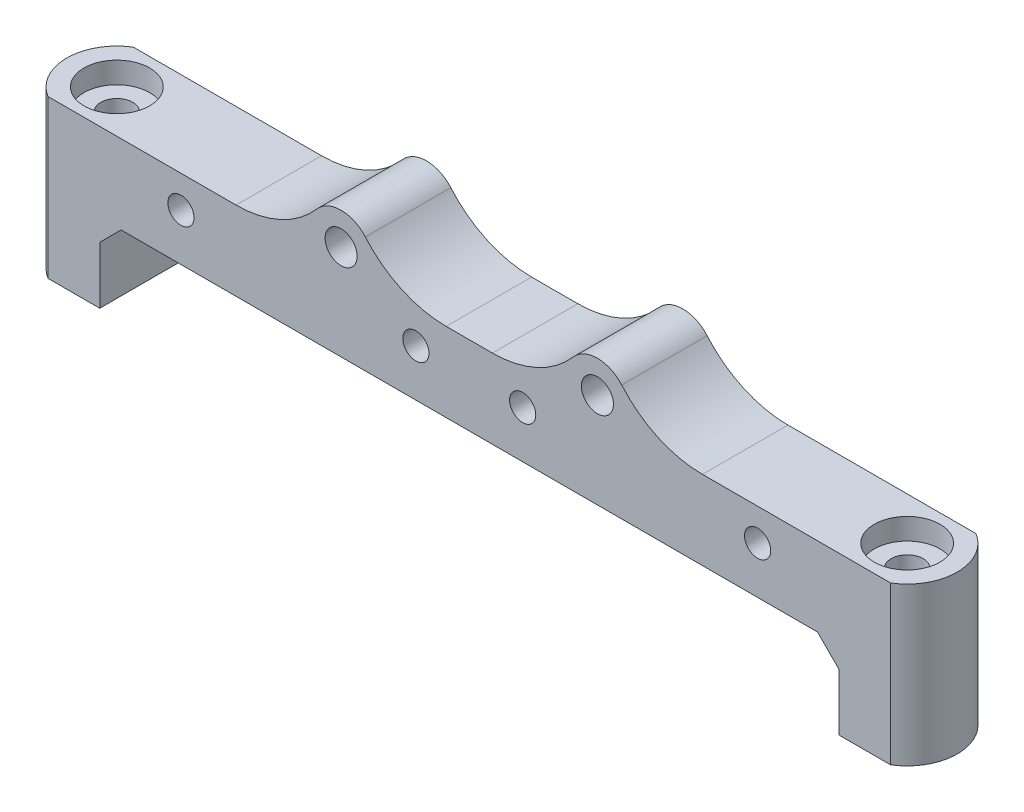
ISO-10303-21;
HEADER;
FILE_DESCRIPTION(('STEP AP214'),'2;1');
FILE_NAME('part.step','',(''),(''),'','','');
FILE_SCHEMA(('AUTOMOTIVE_DESIGN { 1 0 10303 214 1 1 1 1 }'));
ENDSEC;
DATA;
#1=APPLICATION_CONTEXT('core data for automotive mechanical design processes');
#2=APPLICATION_PROTOCOL_DEFINITION('international standard','automotive_design',2000,#1);
#3=PRODUCT_CONTEXT('',#1,'mechanical');
#4=PRODUCT('Part','Part','',(#3));
#5=PRODUCT_RELATED_PRODUCT_CATEGORY('part','',(#4));
#6=PRODUCT_DEFINITION_FORMATION('','',#4);
#7=PRODUCT_DEFINITION_CONTEXT('part definition',#1,'design');
#8=PRODUCT_DEFINITION('design','',#6,#7);
#9=PRODUCT_DEFINITION_SHAPE('','',#8);
#10=(LENGTH_UNIT() NAMED_UNIT(*) SI_UNIT(.MILLI.,.METRE.));
#11=(NAMED_UNIT(*) PLANE_ANGLE_UNIT() SI_UNIT($,.RADIAN.));
#12=(NAMED_UNIT(*) SI_UNIT($,.STERADIAN.) SOLID_ANGLE_UNIT());
#13=UNCERTAINTY_MEASURE_WITH_UNIT(LENGTH_MEASURE(1.E-05),#10,'distance_accuracy_value','');
#14=(GEOMETRIC_REPRESENTATION_CONTEXT(3) GLOBAL_UNCERTAINTY_ASSIGNED_CONTEXT((#13)) GLOBAL_UNIT_ASSIGNED_CONTEXT((#10,
#11,#12)) REPRESENTATION_CONTEXT('',''));
#15=CARTESIAN_POINT('',(0.,0.,0.));
#16=DIRECTION('',(0.,0.,1.));
#17=DIRECTION('',(1.,0.,0.));
#18=AXIS2_PLACEMENT_3D('',#15,#16,#17);
#19=CARTESIAN_POINT('',(27.,11.75,8.));
#20=DIRECTION('',(0.,0.,-1.));
#21=DIRECTION('',(-1.,0.,0.));
#22=AXIS2_PLACEMENT_3D('',#19,#20,#21);
#23=CYLINDRICAL_SURFACE('',#22,1.);
#24=CARTESIAN_POINT('',(27.,11.75,0.));
#25=DIRECTION('',(0.,0.,1.));
#26=DIRECTION('',(1.,0.,0.));
#27=AXIS2_PLACEMENT_3D('',#24,#25,#26);
#28=CIRCLE('',#27,1.);
#29=CARTESIAN_POINT('',(28.,11.75,0.));
#30=VERTEX_POINT('',#29);
#31=EDGE_CURVE('E198',#30,#30,#28,.T.);
#32=ORIENTED_EDGE('',*,*,#31,.F.);
#33=EDGE_LOOP('',(#32));
#34=FACE_BOUND('',#33,.T.);
#35=CARTESIAN_POINT('',(27.,11.75,3.));
#36=DIRECTION('',(0.,0.,1.));
#37=DIRECTION('',(1.,0.,0.));
#38=AXIS2_PLACEMENT_3D('',#35,#36,#37);
#39=CIRCLE('',#38,1.);
#40=CARTESIAN_POINT('',(28.,11.75,3.));
#41=VERTEX_POINT('',#40);
#42=EDGE_CURVE('E39',#41,#41,#39,.T.);
#43=ORIENTED_EDGE('',*,*,#42,.T.);
#44=EDGE_LOOP('',(#43));
#45=FACE_BOUND('',#44,.T.);
#46=ADVANCED_FACE('F35',(#34,#45),#23,.F.);
#47=CARTESIAN_POINT('',(-5.,11.75,8.));
#48=DIRECTION('',(0.,0.,-1.));
#49=DIRECTION('',(-1.,0.,0.));
#50=AXIS2_PLACEMENT_3D('',#47,#48,#49);
#51=CYLINDRICAL_SURFACE('',#50,1.);
#52=CARTESIAN_POINT('',(-5.,11.75,0.));
#53=DIRECTION('',(0.,0.,1.));
#54=DIRECTION('',(1.,0.,0.));
#55=AXIS2_PLACEMENT_3D('',#52,#53,#54);
#56=CIRCLE('',#55,1.);
#57=CARTESIAN_POINT('',(-4.,11.75,0.));
#58=VERTEX_POINT('',#57);
#59=EDGE_CURVE('E343',#58,#58,#56,.T.);
#60=ORIENTED_EDGE('',*,*,#59,.F.);
#61=EDGE_LOOP('',(#60));
#62=FACE_BOUND('',#61,.T.);
#63=CARTESIAN_POINT('',(-5.,11.75,3.));
#64=DIRECTION('',(0.,0.,1.));
#65=DIRECTION('',(1.,0.,0.));
#66=AXIS2_PLACEMENT_3D('',#63,#64,#65);
#67=CIRCLE('',#66,1.);
#68=CARTESIAN_POINT('',(-4.,11.75,3.));
#69=VERTEX_POINT('',#68);
#70=EDGE_CURVE('E299',#69,#69,#67,.T.);
#71=ORIENTED_EDGE('',*,*,#70,.T.);
#72=EDGE_LOOP('',(#71));
#73=FACE_BOUND('',#72,.T.);
#74=ADVANCED_FACE('F443',(#62,#73),#51,.F.);
#75=CARTESIAN_POINT('',(5.,11.75,8.));
#76=DIRECTION('',(0.,0.,-1.));
#77=DIRECTION('',(-1.,0.,0.));
#78=AXIS2_PLACEMENT_3D('',#75,#76,#77);
#79=CYLINDRICAL_SURFACE('',#78,1.);
#80=CARTESIAN_POINT('',(5.,11.75,0.));
#81=DIRECTION('',(0.,0.,1.));
#82=DIRECTION('',(1.,0.,0.));
#83=AXIS2_PLACEMENT_3D('',#80,#81,#82);
#84=CIRCLE('',#83,1.);
#85=CARTESIAN_POINT('',(6.,11.75,0.));
#86=VERTEX_POINT('',#85);
#87=EDGE_CURVE('E340',#86,#86,#84,.T.);
#88=ORIENTED_EDGE('',*,*,#87,.F.);
#89=EDGE_LOOP('',(#88));
#90=FACE_BOUND('',#89,.T.);
#91=CARTESIAN_POINT('',(5.,11.75,3.));
#92=DIRECTION('',(0.,0.,1.));
#93=DIRECTION('',(1.,0.,0.));
#94=AXIS2_PLACEMENT_3D('',#91,#92,#93);
#95=CIRCLE('',#94,1.);
#96=CARTESIAN_POINT('',(6.,11.75,3.));
#97=VERTEX_POINT('',#96);
#98=EDGE_CURVE('E296',#97,#97,#95,.T.);
#99=ORIENTED_EDGE('',*,*,#98,.T.);
#100=EDGE_LOOP('',(#99));
#101=FACE_BOUND('',#100,.T.);
#102=ADVANCED_FACE('F449',(#90,#101),#79,.F.);
#103=CARTESIAN_POINT('',(-27.,11.75,8.));
#104=DIRECTION('',(0.,0.,-1.));
#105=DIRECTION('',(-1.,0.,0.));
#106=AXIS2_PLACEMENT_3D('',#103,#104,#105);
#107=CYLINDRICAL_SURFACE('',#106,1.);
#108=CARTESIAN_POINT('',(-27.,11.75,0.));
#109=DIRECTION('',(0.,0.,1.));
#110=DIRECTION('',(1.,0.,0.));
#111=AXIS2_PLACEMENT_3D('',#108,#109,#110);
#112=CIRCLE('',#111,1.);
#113=CARTESIAN_POINT('',(-26.,11.75,0.));
#114=VERTEX_POINT('',#113);
#115=EDGE_CURVE('E335',#114,#114,#112,.T.);
#116=ORIENTED_EDGE('',*,*,#115,.F.);
#117=EDGE_LOOP('',(#116));
#118=FACE_BOUND('',#117,.T.);
#119=CARTESIAN_POINT('',(-27.,11.75,3.));
#120=DIRECTION('',(0.,0.,1.));
#121=DIRECTION('',(1.,0.,0.));
#122=AXIS2_PLACEMENT_3D('',#119,#120,#121);
#123=CIRCLE('',#122,1.);
#124=CARTESIAN_POINT('',(-26.,11.75,3.));
#125=VERTEX_POINT('',#124);
#126=EDGE_CURVE('E293',#125,#125,#123,.T.);
#127=ORIENTED_EDGE('',*,*,#126,.T.);
#128=EDGE_LOOP('',(#127));
#129=FACE_BOUND('',#128,.T.);
#130=ADVANCED_FACE('F473',(#118,#129),#107,.F.);
#131=CARTESIAN_POINT('',(-37.,19.25,4.));
#132=DIRECTION('',(0.,-1.,0.));
#133=DIRECTION('',(1.,0.,0.));
#134=AXIS2_PLACEMENT_3D('',#131,#132,#133);
#135=CYLINDRICAL_SURFACE('',#134,1.5);
#136=CARTESIAN_POINT('',(-37.,0.,4.));
#137=DIRECTION('',(0.,-1.,0.));
#138=DIRECTION('',(1.,0.,0.));
#139=AXIS2_PLACEMENT_3D('',#136,#137,#138);
#140=CIRCLE('',#139,1.5);
#141=CARTESIAN_POINT('',(-35.5,0.,4.));
#142=VERTEX_POINT('',#141);
#143=EDGE_CURVE('E320',#142,#142,#140,.T.);
#144=ORIENTED_EDGE('',*,*,#143,.T.);
#145=EDGE_LOOP('',(#144));
#146=FACE_BOUND('',#145,.T.);
#147=CARTESIAN_POINT('',(-37.,12.75,4.));
#148=DIRECTION('',(0.,1.,0.));
#149=DIRECTION('',(-1.,0.,0.));
#150=AXIS2_PLACEMENT_3D('',#147,#148,#149);
#151=CIRCLE('',#150,1.5);
#152=CARTESIAN_POINT('',(-38.5,12.75,4.));
#153=VERTEX_POINT('',#152);
#154=EDGE_CURVE('E234',#153,#153,#151,.F.);
#155=ORIENTED_EDGE('',*,*,#154,.F.);
#156=EDGE_LOOP('',(#155));
#157=FACE_BOUND('',#156,.T.);
#158=ADVANCED_FACE('F470',(#146,#157),#135,.F.);
#159=CARTESIAN_POINT('',(37.,19.25,4.));
#160=DIRECTION('',(0.,-1.,0.));
#161=DIRECTION('',(1.,0.,0.));
#162=AXIS2_PLACEMENT_3D('',#159,#160,#161);
#163=CYLINDRICAL_SURFACE('',#162,1.5);
#164=CARTESIAN_POINT('',(37.,0.,4.));
#165=DIRECTION('',(0.,-1.,0.));
#166=DIRECTION('',(1.,0.,0.));
#167=AXIS2_PLACEMENT_3D('',#164,#165,#166);
#168=CIRCLE('',#167,1.5);
#169=CARTESIAN_POINT('',(38.5,0.,4.));
#170=VERTEX_POINT('',#169);
#171=EDGE_CURVE('E318',#170,#170,#168,.T.);
#172=ORIENTED_EDGE('',*,*,#171,.T.);
#173=EDGE_LOOP('',(#172));
#174=FACE_BOUND('',#173,.T.);
#175=CARTESIAN_POINT('',(37.,12.75,4.));
#176=DIRECTION('',(0.,1.,0.));
#177=DIRECTION('',(-1.,0.,0.));
#178=AXIS2_PLACEMENT_3D('',#175,#176,#177);
#179=CIRCLE('',#178,1.5);
#180=CARTESIAN_POINT('',(35.5,12.75,4.));
#181=VERTEX_POINT('',#180);
#182=EDGE_CURVE('E231',#181,#181,#179,.F.);
#183=ORIENTED_EDGE('',*,*,#182,.F.);
#184=EDGE_LOOP('',(#183));
#185=FACE_BOUND('',#184,.T.);
#186=ADVANCED_FACE('F457',(#174,#185),#163,.F.);
#187=CARTESIAN_POINT('',(12.,16.25,8.));
#188=DIRECTION('',(0.,0.,1.));
#189=DIRECTION('',(1.,0.,0.));
#190=AXIS2_PLACEMENT_3D('',#187,#188,#189);
#191=PLANE('',#190);
#192=CARTESIAN_POINT('',(-27.,11.75,8.));
#193=DIRECTION('',(0.,0.,1.));
#194=DIRECTION('',(1.,0.,0.));
#195=AXIS2_PLACEMENT_3D('',#192,#193,#194);
#196=CIRCLE('',#195,1.225);
#197=CARTESIAN_POINT('',(-25.775,11.75,8.));
#198=VERTEX_POINT('',#197);
#199=EDGE_CURVE('E858',#198,#198,#196,.T.);
#200=ORIENTED_EDGE('',*,*,#199,.F.);
#201=EDGE_LOOP('',(#200));
#202=FACE_BOUND('',#201,.T.);
#203=CARTESIAN_POINT('',(-5.,11.75,8.));
#204=DIRECTION('',(0.,0.,1.));
#205=DIRECTION('',(1.,0.,0.));
#206=AXIS2_PLACEMENT_3D('',#203,#204,#205);
#207=CIRCLE('',#206,1.225);
#208=CARTESIAN_POINT('',(-3.775,11.75,8.));
#209=VERTEX_POINT('',#208);
#210=EDGE_CURVE('E526',#209,#209,#207,.T.);
#211=ORIENTED_EDGE('',*,*,#210,.F.);
#212=EDGE_LOOP('',(#211));
#213=FACE_BOUND('',#212,.T.);
#214=CARTESIAN_POINT('',(5.,11.75,8.));
#215=DIRECTION('',(0.,0.,1.));
#216=DIRECTION('',(1.,0.,0.));
#217=AXIS2_PLACEMENT_3D('',#214,#215,#216);
#218=CIRCLE('',#217,1.225);
#219=CARTESIAN_POINT('',(6.225,11.75,8.));
#220=VERTEX_POINT('',#219);
#221=EDGE_CURVE('E527',#220,#220,#218,.T.);
#222=ORIENTED_EDGE('',*,*,#221,.F.);
#223=EDGE_LOOP('',(#222));
#224=FACE_BOUND('',#223,.T.);
#225=CARTESIAN_POINT('',(27.,11.75,8.));
#226=DIRECTION('',(0.,0.,1.));
#227=DIRECTION('',(1.,0.,0.));
#228=AXIS2_PLACEMENT_3D('',#225,#226,#227);
#229=CIRCLE('',#228,1.225);
#230=CARTESIAN_POINT('',(28.225,11.75,8.));
#231=VERTEX_POINT('',#230);
#232=EDGE_CURVE('E538',#231,#231,#229,.T.);
#233=ORIENTED_EDGE('',*,*,#232,.F.);
#234=EDGE_LOOP('',(#233));
#235=FACE_BOUND('',#234,.T.);
#236=CARTESIAN_POINT('',(12.,16.25,8.));
#237=DIRECTION('',(0.,0.,1.));
#238=DIRECTION('',(1.,0.,0.));
#239=AXIS2_PLACEMENT_3D('',#236,#237,#238);
#240=CIRCLE('',#239,1.5);
#241=CARTESIAN_POINT('',(13.5,16.25,8.));
#242=VERTEX_POINT('',#241);
#243=EDGE_CURVE('E332',#242,#242,#240,.T.);
#244=ORIENTED_EDGE('',*,*,#243,.F.);
#245=EDGE_LOOP('',(#244));
#246=FACE_BOUND('',#245,.T.);
#247=DIRECTION('',(0.,1.,0.));
#248=VECTOR('',#247,1.);
#249=CARTESIAN_POINT('',(-34.6,7.35,8.));
#250=LINE('',#249,#248);
#251=CARTESIAN_POINT('',(-34.6,0.,8.));
#252=VERTEX_POINT('',#251);
#253=CARTESIAN_POINT('',(-34.6,5.35,8.));
#254=VERTEX_POINT('',#253);
#255=EDGE_CURVE('E189',#252,#254,#250,.T.);
#256=ORIENTED_EDGE('',*,*,#255,.T.);
#257=DIRECTION('',(-0.707106781186552,-0.707106781186543,0.));
#258=VECTOR('',#257,1.);
#259=CARTESIAN_POINT('',(-32.6,7.35,8.));
#260=LINE('',#259,#258);
#261=CARTESIAN_POINT('',(-32.6,7.35,8.));
#262=VERTEX_POINT('',#261);
#263=EDGE_CURVE('E255',#254,#262,#260,.F.);
#264=ORIENTED_EDGE('',*,*,#263,.T.);
#265=DIRECTION('',(1.,0.,0.));
#266=VECTOR('',#265,1.);
#267=CARTESIAN_POINT('',(-34.6,7.35,8.));
#268=LINE('',#267,#266);
#269=CARTESIAN_POINT('',(32.6,7.35,8.));
#270=VERTEX_POINT('',#269);
#271=EDGE_CURVE('E225',#262,#270,#268,.T.);
#272=ORIENTED_EDGE('',*,*,#271,.T.);
#273=DIRECTION('',(-0.707106781186544,0.707106781186551,0.));
#274=VECTOR('',#273,1.);
#275=CARTESIAN_POINT('',(34.6,5.34999999999998,8.));
#276=LINE('',#275,#274);
#277=CARTESIAN_POINT('',(34.6,5.34999999999998,8.));
#278=VERTEX_POINT('',#277);
#279=EDGE_CURVE('E259',#270,#278,#276,.F.);
#280=ORIENTED_EDGE('',*,*,#279,.T.);
#281=DIRECTION('',(0.,-1.,0.));
#282=VECTOR('',#281,1.);
#283=CARTESIAN_POINT('',(34.6,7.35,8.));
#284=LINE('',#283,#282);
#285=CARTESIAN_POINT('',(34.6,0.,8.));
#286=VERTEX_POINT('',#285);
#287=EDGE_CURVE('E350',#278,#286,#284,.T.);
#288=ORIENTED_EDGE('',*,*,#287,.T.);
#289=DIRECTION('',(1.,0.,0.));
#290=VECTOR('',#289,1.);
#291=CARTESIAN_POINT('',(39.45,0.,8.));
#292=LINE('',#291,#290);
#293=CARTESIAN_POINT('',(39.45,0.,8.));
#294=VERTEX_POINT('',#293);
#295=EDGE_CURVE('E352',#286,#294,#292,.T.);
#296=ORIENTED_EDGE('',*,*,#295,.T.);
#297=DIRECTION('',(0.,1.,0.));
#298=VECTOR('',#297,1.);
#299=CARTESIAN_POINT('',(39.45,14.75,8.));
#300=LINE('',#299,#298);
#301=CARTESIAN_POINT('',(39.45,14.75,8.));
#302=VERTEX_POINT('',#301);
#303=EDGE_CURVE('E355',#294,#302,#300,.T.);
#304=ORIENTED_EDGE('',*,*,#303,.T.);
#305=DIRECTION('',(-1.,0.,0.));
#306=VECTOR('',#305,1.);
#307=CARTESIAN_POINT('',(14.5980762113533,14.75,8.));
#308=LINE('',#307,#306);
#309=CARTESIAN_POINT('',(21.836157786453,14.75,8.));
#310=VERTEX_POINT('',#309);
#311=EDGE_CURVE('E358',#302,#310,#308,.T.);
#312=ORIENTED_EDGE('',*,*,#311,.T.);
#313=CARTESIAN_POINT('',(21.836157786453,24.75,8.));
#314=DIRECTION('',(0.,0.,1.));
#315=DIRECTION('',(1.,0.,0.));
#316=AXIS2_PLACEMENT_3D('',#313,#314,#315);
#317=CIRCLE('',#316,10.);
#318=CARTESIAN_POINT('',(14.2698825661045,18.2115384615385,8.));
#319=VERTEX_POINT('',#318);
#320=EDGE_CURVE('E11',#310,#319,#317,.F.);
#321=ORIENTED_EDGE('',*,*,#320,.T.);
#322=CARTESIAN_POINT('',(12.,16.25,8.));
#323=DIRECTION('',(0.,0.,1.));
#324=DIRECTION('',(1.,0.,0.));
#325=AXIS2_PLACEMENT_3D('',#322,#323,#324);
#326=CIRCLE('',#325,3.);
#327=CARTESIAN_POINT('',(9.73011743389546,18.2115384615385,8.));
#328=VERTEX_POINT('',#327);
#329=EDGE_CURVE('E360',#319,#328,#326,.T.);
#330=ORIENTED_EDGE('',*,*,#329,.T.);
#331=CARTESIAN_POINT('',(2.163842213547,24.75,8.));
#332=DIRECTION('',(0.,0.,1.));
#333=DIRECTION('',(1.,0.,0.));
#334=AXIS2_PLACEMENT_3D('',#331,#332,#333);
#335=CIRCLE('',#334,10.);
#336=CARTESIAN_POINT('',(2.163842213547,14.75,8.));
#337=VERTEX_POINT('',#336);
#338=EDGE_CURVE('E290',#328,#337,#335,.F.);
#339=ORIENTED_EDGE('',*,*,#338,.T.);
#340=DIRECTION('',(-1.,0.,0.));
#341=VECTOR('',#340,1.);
#342=CARTESIAN_POINT('',(-9.40192378864669,14.75,8.));
#343=LINE('',#342,#341);
#344=CARTESIAN_POINT('',(-2.163842213547,14.75,8.));
#345=VERTEX_POINT('',#344);
#346=EDGE_CURVE('E363',#337,#345,#343,.T.);
#347=ORIENTED_EDGE('',*,*,#346,.T.);
#348=CARTESIAN_POINT('',(-2.163842213547,24.75,8.));
#349=DIRECTION('',(0.,0.,1.));
#350=DIRECTION('',(1.,0.,0.));
#351=AXIS2_PLACEMENT_3D('',#348,#349,#350);
#352=CIRCLE('',#351,10.);
#353=CARTESIAN_POINT('',(-9.73011743389546,18.2115384615385,8.));
#354=VERTEX_POINT('',#353);
#355=EDGE_CURVE('E286',#345,#354,#352,.F.);
#356=ORIENTED_EDGE('',*,*,#355,.T.);
#357=CARTESIAN_POINT('',(-12.,16.25,8.));
#358=DIRECTION('',(0.,0.,1.));
#359=DIRECTION('',(1.,0.,0.));
#360=AXIS2_PLACEMENT_3D('',#357,#358,#359);
#361=CIRCLE('',#360,3.);
#362=CARTESIAN_POINT('',(-14.2698825661045,18.2115384615385,8.));
#363=VERTEX_POINT('',#362);
#364=EDGE_CURVE('E366',#354,#363,#361,.T.);
#365=ORIENTED_EDGE('',*,*,#364,.T.);
#366=CARTESIAN_POINT('',(-21.836157786453,24.75,8.));
#367=DIRECTION('',(0.,0.,1.));
#368=DIRECTION('',(1.,0.,0.));
#369=AXIS2_PLACEMENT_3D('',#366,#367,#368);
#370=CIRCLE('',#369,10.);
#371=CARTESIAN_POINT('',(-21.836157786453,14.75,8.));
#372=VERTEX_POINT('',#371);
#373=EDGE_CURVE('E282',#363,#372,#370,.F.);
#374=ORIENTED_EDGE('',*,*,#373,.T.);
#375=DIRECTION('',(-1.,0.,0.));
#376=VECTOR('',#375,1.);
#377=CARTESIAN_POINT('',(-39.45,14.75,8.));
#378=LINE('',#377,#376);
#379=CARTESIAN_POINT('',(-39.45,14.75,8.));
#380=VERTEX_POINT('',#379);
#381=EDGE_CURVE('E183',#372,#380,#378,.T.);
#382=ORIENTED_EDGE('',*,*,#381,.T.);
#383=DIRECTION('',(0.,-1.,0.));
#384=VECTOR('',#383,1.);
#385=CARTESIAN_POINT('',(-39.45,0.,8.));
#386=LINE('',#385,#384);
#387=CARTESIAN_POINT('',(-39.45,0.,8.));
#388=VERTEX_POINT('',#387);
#389=EDGE_CURVE('E166',#380,#388,#386,.T.);
#390=ORIENTED_EDGE('',*,*,#389,.T.);
#391=DIRECTION('',(1.,0.,0.));
#392=VECTOR('',#391,1.);
#393=CARTESIAN_POINT('',(-34.6,0.,8.));
#394=LINE('',#393,#392);
#395=EDGE_CURVE('E180',#388,#252,#394,.T.);
#396=ORIENTED_EDGE('',*,*,#395,.T.);
#397=EDGE_LOOP('',(#256,#264,#272,#280,#288,#296,#304,#312,#321,#330,#339,#347,#356,#365,#374,
#382,#390,#396));
#398=FACE_BOUND('',#397,.T.);
#399=CARTESIAN_POINT('',(-12.,16.25,8.));
#400=DIRECTION('',(0.,0.,1.));
#401=DIRECTION('',(1.,0.,0.));
#402=AXIS2_PLACEMENT_3D('',#399,#400,#401);
#403=CIRCLE('',#402,1.5);
#404=CARTESIAN_POINT('',(-10.5,16.25,8.));
#405=VERTEX_POINT('',#404);
#406=EDGE_CURVE('E326',#405,#405,#403,.T.);
#407=ORIENTED_EDGE('',*,*,#406,.F.);
#408=EDGE_LOOP('',(#407));
#409=FACE_BOUND('',#408,.T.);
#410=ADVANCED_FACE('F178',(#202,#213,#224,#235,#246,#398,#409),#191,.T.);
#411=CARTESIAN_POINT('',(12.,16.25,0.));
#412=DIRECTION('',(0.,0.,1.));
#413=DIRECTION('',(1.,0.,0.));
#414=AXIS2_PLACEMENT_3D('',#411,#412,#413);
#415=PLANE('',#414);
#416=DIRECTION('',(1.,0.,0.));
#417=VECTOR('',#416,1.);
#418=CARTESIAN_POINT('',(-34.6,7.35,0.));
#419=LINE('',#418,#417);
#420=CARTESIAN_POINT('',(-32.6,7.35,0.));
#421=VERTEX_POINT('',#420);
#422=CARTESIAN_POINT('',(32.6,7.35,0.));
#423=VERTEX_POINT('',#422);
#424=EDGE_CURVE('E194',#421,#423,#419,.T.);
#425=ORIENTED_EDGE('',*,*,#424,.F.);
#426=DIRECTION('',(0.707106781186552,0.707106781186543,0.));
#427=VECTOR('',#426,1.);
#428=CARTESIAN_POINT('',(-5.84999999999968,34.0999999999999,0.));
#429=LINE('',#428,#427);
#430=CARTESIAN_POINT('',(-34.6,5.35,0.));
#431=VERTEX_POINT('',#430);
#432=EDGE_CURVE('E253',#421,#431,#429,.F.);
#433=ORIENTED_EDGE('',*,*,#432,.T.);
#434=DIRECTION('',(0.,1.,0.));
#435=VECTOR('',#434,1.);
#436=CARTESIAN_POINT('',(-34.6,7.35,0.));
#437=LINE('',#436,#435);
#438=CARTESIAN_POINT('',(-34.6,0.,0.));
#439=VERTEX_POINT('',#438);
#440=EDGE_CURVE('E222',#439,#431,#437,.T.);
#441=ORIENTED_EDGE('',*,*,#440,.F.);
#442=DIRECTION('',(1.,0.,0.));
#443=VECTOR('',#442,1.);
#444=CARTESIAN_POINT('',(-34.6,0.,0.));
#445=LINE('',#444,#443);
#446=CARTESIAN_POINT('',(-39.45,0.,0.));
#447=VERTEX_POINT('',#446);
#448=EDGE_CURVE('E220',#447,#439,#445,.T.);
#449=ORIENTED_EDGE('',*,*,#448,.F.);
#450=DIRECTION('',(0.,-1.,0.));
#451=VECTOR('',#450,1.);
#452=CARTESIAN_POINT('',(-39.45,0.,0.));
#453=LINE('',#452,#451);
#454=CARTESIAN_POINT('',(-39.45,14.75,0.));
#455=VERTEX_POINT('',#454);
#456=EDGE_CURVE('E169',#455,#447,#453,.T.);
#457=ORIENTED_EDGE('',*,*,#456,.F.);
#458=DIRECTION('',(-1.,0.,0.));
#459=VECTOR('',#458,1.);
#460=CARTESIAN_POINT('',(-39.45,14.75,0.));
#461=LINE('',#460,#459);
#462=CARTESIAN_POINT('',(-21.836157786453,14.75,0.));
#463=VERTEX_POINT('',#462);
#464=EDGE_CURVE('E217',#463,#455,#461,.T.);
#465=ORIENTED_EDGE('',*,*,#464,.F.);
#466=CARTESIAN_POINT('',(-21.836157786453,24.75,0.));
#467=DIRECTION('',(0.,0.,1.));
#468=DIRECTION('',(1.,0.,0.));
#469=AXIS2_PLACEMENT_3D('',#466,#467,#468);
#470=CIRCLE('',#469,10.);
#471=CARTESIAN_POINT('',(-14.2698825661045,18.2115384615385,0.));
#472=VERTEX_POINT('',#471);
#473=EDGE_CURVE('E280',#463,#472,#470,.T.);
#474=ORIENTED_EDGE('',*,*,#473,.T.);
#475=CARTESIAN_POINT('',(-12.,16.25,0.));
#476=DIRECTION('',(0.,0.,1.));
#477=DIRECTION('',(1.,0.,0.));
#478=AXIS2_PLACEMENT_3D('',#475,#476,#477);
#479=CIRCLE('',#478,3.);
#480=CARTESIAN_POINT('',(-9.73011743389546,18.2115384615385,0.));
#481=VERTEX_POINT('',#480);
#482=EDGE_CURVE('E214',#481,#472,#479,.T.);
#483=ORIENTED_EDGE('',*,*,#482,.F.);
#484=CARTESIAN_POINT('',(-2.163842213547,24.75,0.));
#485=DIRECTION('',(0.,0.,1.));
#486=DIRECTION('',(1.,0.,0.));
#487=AXIS2_PLACEMENT_3D('',#484,#485,#486);
#488=CIRCLE('',#487,10.);
#489=CARTESIAN_POINT('',(-2.163842213547,14.75,0.));
#490=VERTEX_POINT('',#489);
#491=EDGE_CURVE('E284',#481,#490,#488,.T.);
#492=ORIENTED_EDGE('',*,*,#491,.T.);
#493=DIRECTION('',(-1.,0.,0.));
#494=VECTOR('',#493,1.);
#495=CARTESIAN_POINT('',(-9.40192378864669,14.75,0.));
#496=LINE('',#495,#494);
#497=CARTESIAN_POINT('',(2.163842213547,14.75,0.));
#498=VERTEX_POINT('',#497);
#499=EDGE_CURVE('E211',#498,#490,#496,.T.);
#500=ORIENTED_EDGE('',*,*,#499,.F.);
#501=CARTESIAN_POINT('',(2.163842213547,24.75,0.));
#502=DIRECTION('',(0.,0.,1.));
#503=DIRECTION('',(1.,0.,0.));
#504=AXIS2_PLACEMENT_3D('',#501,#502,#503);
#505=CIRCLE('',#504,10.);
#506=CARTESIAN_POINT('',(9.73011743389546,18.2115384615385,0.));
#507=VERTEX_POINT('',#506);
#508=EDGE_CURVE('E288',#498,#507,#505,.T.);
#509=ORIENTED_EDGE('',*,*,#508,.T.);
#510=CARTESIAN_POINT('',(12.,16.25,0.));
#511=DIRECTION('',(0.,0.,1.));
#512=DIRECTION('',(1.,0.,0.));
#513=AXIS2_PLACEMENT_3D('',#510,#511,#512);
#514=CIRCLE('',#513,3.);
#515=CARTESIAN_POINT('',(14.2698825661045,18.2115384615385,0.));
#516=VERTEX_POINT('',#515);
#517=EDGE_CURVE('E208',#516,#507,#514,.T.);
#518=ORIENTED_EDGE('',*,*,#517,.F.);
#519=CARTESIAN_POINT('',(21.836157786453,24.75,0.));
#520=DIRECTION('',(0.,0.,1.));
#521=DIRECTION('',(1.,0.,0.));
#522=AXIS2_PLACEMENT_3D('',#519,#520,#521);
#523=CIRCLE('',#522,10.);
#524=CARTESIAN_POINT('',(21.836157786453,14.75,0.));
#525=VERTEX_POINT('',#524);
#526=EDGE_CURVE('E44',#516,#525,#523,.T.);
#527=ORIENTED_EDGE('',*,*,#526,.T.);
#528=DIRECTION('',(-1.,0.,0.));
#529=VECTOR('',#528,1.);
#530=CARTESIAN_POINT('',(14.5980762113533,14.75,0.));
#531=LINE('',#530,#529);
#532=CARTESIAN_POINT('',(39.45,14.75,0.));
#533=VERTEX_POINT('',#532);
#534=EDGE_CURVE('E206',#533,#525,#531,.T.);
#535=ORIENTED_EDGE('',*,*,#534,.F.);
#536=DIRECTION('',(0.,1.,0.));
#537=VECTOR('',#536,1.);
#538=CARTESIAN_POINT('',(39.45,14.75,0.));
#539=LINE('',#538,#537);
#540=CARTESIAN_POINT('',(39.45,0.,0.));
#541=VERTEX_POINT('',#540);
#542=EDGE_CURVE('E203',#541,#533,#539,.T.);
#543=ORIENTED_EDGE('',*,*,#542,.F.);
#544=DIRECTION('',(1.,0.,0.));
#545=VECTOR('',#544,1.);
#546=CARTESIAN_POINT('',(39.45,0.,0.));
#547=LINE('',#546,#545);
#548=CARTESIAN_POINT('',(34.6,0.,0.));
#549=VERTEX_POINT('',#548);
#550=EDGE_CURVE('E200',#549,#541,#547,.T.);
#551=ORIENTED_EDGE('',*,*,#550,.F.);
#552=DIRECTION('',(0.,-1.,0.));
#553=VECTOR('',#552,1.);
#554=CARTESIAN_POINT('',(34.6,7.35,0.));
#555=LINE('',#554,#553);
#556=CARTESIAN_POINT('',(34.6,5.34999999999998,0.));
#557=VERTEX_POINT('',#556);
#558=EDGE_CURVE('E197',#557,#549,#555,.T.);
#559=ORIENTED_EDGE('',*,*,#558,.F.);
#560=DIRECTION('',(0.707106781186544,-0.707106781186551,0.));
#561=VECTOR('',#560,1.);
#562=CARTESIAN_POINT('',(17.8500000000001,22.1000000000001,0.));
#563=LINE('',#562,#561);
#564=EDGE_CURVE('E257',#557,#423,#563,.F.);
#565=ORIENTED_EDGE('',*,*,#564,.T.);
#566=EDGE_LOOP('',(#425,#433,#441,#449,#457,#465,#474,#483,#492,#500,#509,#518,#527,#535,#543,
#551,#559,#565));
#567=FACE_BOUND('',#566,.T.);
#568=ORIENTED_EDGE('',*,*,#31,.T.);
#569=EDGE_LOOP('',(#568));
#570=FACE_BOUND('',#569,.T.);
#571=ORIENTED_EDGE('',*,*,#59,.T.);
#572=EDGE_LOOP('',(#571));
#573=FACE_BOUND('',#572,.T.);
#574=ORIENTED_EDGE('',*,*,#87,.T.);
#575=EDGE_LOOP('',(#574));
#576=FACE_BOUND('',#575,.T.);
#577=ORIENTED_EDGE('',*,*,#115,.T.);
#578=EDGE_LOOP('',(#577));
#579=FACE_BOUND('',#578,.T.);
#580=CARTESIAN_POINT('',(12.,16.25,0.));
#581=DIRECTION('',(0.,0.,1.));
#582=DIRECTION('',(1.,0.,0.));
#583=AXIS2_PLACEMENT_3D('',#580,#581,#582);
#584=CIRCLE('',#583,1.5);
#585=CARTESIAN_POINT('',(13.5,16.25,0.));
#586=VERTEX_POINT('',#585);
#587=EDGE_CURVE('E329',#586,#586,#584,.T.);
#588=ORIENTED_EDGE('',*,*,#587,.T.);
#589=EDGE_LOOP('',(#588));
#590=FACE_BOUND('',#589,.T.);
#591=CARTESIAN_POINT('',(-12.,16.25,0.));
#592=DIRECTION('',(0.,0.,1.));
#593=DIRECTION('',(1.,0.,0.));
#594=AXIS2_PLACEMENT_3D('',#591,#592,#593);
#595=CIRCLE('',#594,1.5);
#596=CARTESIAN_POINT('',(-10.5,16.25,0.));
#597=VERTEX_POINT('',#596);
#598=EDGE_CURVE('E323',#597,#597,#595,.T.);
#599=ORIENTED_EDGE('',*,*,#598,.T.);
#600=EDGE_LOOP('',(#599));
#601=FACE_BOUND('',#600,.T.);
#602=ADVANCED_FACE('F381',(#567,#570,#573,#576,#579,#590,#601),#415,.F.);
#603=CARTESIAN_POINT('',(-34.6,7.35,8.));
#604=DIRECTION('',(0.,1.,0.));
#605=DIRECTION('',(0.,0.,1.));
#606=AXIS2_PLACEMENT_3D('',#603,#604,#605);
#607=PLANE('',#606);
#608=ORIENTED_EDGE('',*,*,#271,.F.);
#609=DIRECTION('',(0.,0.,-1.));
#610=VECTOR('',#609,1.);
#611=CARTESIAN_POINT('',(-32.6,7.35,0.));
#612=LINE('',#611,#610);
#613=EDGE_CURVE('E245',#262,#421,#612,.T.);
#614=ORIENTED_EDGE('',*,*,#613,.T.);
#615=ORIENTED_EDGE('',*,*,#424,.T.);
#616=DIRECTION('',(0.,0.,1.));
#617=VECTOR('',#616,1.);
#618=CARTESIAN_POINT('',(32.6,7.35,8.));
#619=LINE('',#618,#617);
#620=EDGE_CURVE('E230',#423,#270,#619,.T.);
#621=ORIENTED_EDGE('',*,*,#620,.T.);
#622=EDGE_LOOP('',(#608,#614,#615,#621));
#623=FACE_BOUND('',#622,.T.);
#624=ADVANCED_FACE('F394',(#623),#607,.F.);
#625=CARTESIAN_POINT('',(34.6,7.35,8.));
#626=DIRECTION('',(1.,0.,0.));
#627=DIRECTION('',(0.,0.,-1.));
#628=AXIS2_PLACEMENT_3D('',#625,#626,#627);
#629=PLANE('',#628);
#630=ORIENTED_EDGE('',*,*,#287,.F.);
#631=DIRECTION('',(0.,0.,-1.));
#632=VECTOR('',#631,1.);
#633=CARTESIAN_POINT('',(34.6,5.34999999999998,0.));
#634=LINE('',#633,#632);
#635=EDGE_CURVE('E250',#278,#557,#634,.T.);
#636=ORIENTED_EDGE('',*,*,#635,.T.);
#637=ORIENTED_EDGE('',*,*,#558,.T.);
#638=DIRECTION('',(0.,0.,-1.));
#639=VECTOR('',#638,1.);
#640=CARTESIAN_POINT('',(34.6,0.,8.));
#641=LINE('',#640,#639);
#642=EDGE_CURVE('E227',#286,#549,#641,.T.);
#643=ORIENTED_EDGE('',*,*,#642,.F.);
#644=EDGE_LOOP('',(#630,#636,#637,#643));
#645=FACE_BOUND('',#644,.T.);
#646=ADVANCED_FACE('F404',(#645),#629,.F.);
#647=CARTESIAN_POINT('',(39.45,0.,8.));
#648=DIRECTION('',(0.,1.,0.));
#649=DIRECTION('',(-1.,0.,0.));
#650=AXIS2_PLACEMENT_3D('',#647,#648,#649);
#651=PLANE('',#650);
#652=ORIENTED_EDGE('',*,*,#171,.F.);
#653=EDGE_LOOP('',(#652));
#654=FACE_BOUND('',#653,.T.);
#655=ORIENTED_EDGE('',*,*,#550,.T.);
#656=CARTESIAN_POINT('',(37.,0.,4.));
#657=DIRECTION('',(0.,1.,0.));
#658=DIRECTION('',(-1.,0.,0.));
#659=AXIS2_PLACEMENT_3D('',#656,#657,#658);
#660=CIRCLE('',#659,4.69068225314826);
#661=EDGE_CURVE('E316',#294,#541,#660,.T.);
#662=ORIENTED_EDGE('',*,*,#661,.F.);
#663=ORIENTED_EDGE('',*,*,#295,.F.);
#664=ORIENTED_EDGE('',*,*,#642,.T.);
#665=EDGE_LOOP('',(#655,#662,#663,#664));
#666=FACE_BOUND('',#665,.T.);
#667=ADVANCED_FACE('F409',(#654,#666),#651,.F.);
#668=CARTESIAN_POINT('',(14.5980762113533,14.75,8.));
#669=DIRECTION('',(0.,-1.,0.));
#670=DIRECTION('',(0.,0.,-1.));
#671=AXIS2_PLACEMENT_3D('',#668,#669,#670);
#672=PLANE('',#671);
#673=CARTESIAN_POINT('',(37.,14.75,4.));
#674=DIRECTION('',(0.,-1.,0.));
#675=DIRECTION('',(0.,0.,-1.));
#676=AXIS2_PLACEMENT_3D('',#673,#674,#675);
#677=CIRCLE('',#676,3.075);
#678=CARTESIAN_POINT('',(37.,14.75,0.924999999999996));
#679=VERTEX_POINT('',#678);
#680=EDGE_CURVE('E241',#679,#679,#677,.F.);
#681=ORIENTED_EDGE('',*,*,#680,.F.);
#682=EDGE_LOOP('',(#681));
#683=FACE_BOUND('',#682,.T.);
#684=ORIENTED_EDGE('',*,*,#534,.T.);
#685=DIRECTION('',(0.,0.,1.));
#686=VECTOR('',#685,1.);
#687=CARTESIAN_POINT('',(21.836157786453,14.75,8.));
#688=LINE('',#687,#686);
#689=EDGE_CURVE('E52',#525,#310,#688,.T.);
#690=ORIENTED_EDGE('',*,*,#689,.T.);
#691=ORIENTED_EDGE('',*,*,#311,.F.);
#692=CARTESIAN_POINT('',(37.,14.75,4.));
#693=DIRECTION('',(0.,1.,0.));
#694=DIRECTION('',(-1.,0.,0.));
#695=AXIS2_PLACEMENT_3D('',#692,#693,#694);
#696=CIRCLE('',#695,4.69068225314826);
#697=EDGE_CURVE('E173',#302,#533,#696,.T.);
#698=ORIENTED_EDGE('',*,*,#697,.T.);
#699=EDGE_LOOP('',(#684,#690,#691,#698));
#700=FACE_BOUND('',#699,.T.);
#701=ADVANCED_FACE('F413',(#683,#700),#672,.F.);
#702=CARTESIAN_POINT('',(12.,16.25,8.));
#703=DIRECTION('',(0.,0.,-1.));
#704=DIRECTION('',(-1.,0.,0.));
#705=AXIS2_PLACEMENT_3D('',#702,#703,#704);
#706=CYLINDRICAL_SURFACE('',#705,3.);
#707=ORIENTED_EDGE('',*,*,#517,.T.);
#708=DIRECTION('',(0.,0.,-1.));
#709=VECTOR('',#708,1.);
#710=CARTESIAN_POINT('',(9.73011743389546,18.2115384615385,8.));
#711=LINE('',#710,#709);
#712=EDGE_CURVE('E277',#507,#328,#711,.F.);
#713=ORIENTED_EDGE('',*,*,#712,.T.);
#714=ORIENTED_EDGE('',*,*,#329,.F.);
#715=DIRECTION('',(0.,0.,-1.));
#716=VECTOR('',#715,1.);
#717=CARTESIAN_POINT('',(14.2698825661045,18.2115384615385,8.));
#718=LINE('',#717,#716);
#719=EDGE_CURVE('E274',#319,#516,#718,.T.);
#720=ORIENTED_EDGE('',*,*,#719,.T.);
#721=EDGE_LOOP('',(#707,#713,#714,#720));
#722=FACE_BOUND('',#721,.T.);
#723=ADVANCED_FACE('F419',(#722),#706,.T.);
#724=CARTESIAN_POINT('',(-9.40192378864669,14.75,8.));
#725=DIRECTION('',(0.,-1.,0.));
#726=DIRECTION('',(0.,0.,-1.));
#727=AXIS2_PLACEMENT_3D('',#724,#725,#726);
#728=PLANE('',#727);
#729=ORIENTED_EDGE('',*,*,#499,.T.);
#730=DIRECTION('',(0.,0.,1.));
#731=VECTOR('',#730,1.);
#732=CARTESIAN_POINT('',(-2.163842213547,14.75,8.));
#733=LINE('',#732,#731);
#734=EDGE_CURVE('E272',#490,#345,#733,.T.);
#735=ORIENTED_EDGE('',*,*,#734,.T.);
#736=ORIENTED_EDGE('',*,*,#346,.F.);
#737=DIRECTION('',(0.,0.,1.));
#738=VECTOR('',#737,1.);
#739=CARTESIAN_POINT('',(2.163842213547,14.75,0.));
#740=LINE('',#739,#738);
#741=EDGE_CURVE('E269',#337,#498,#740,.F.);
#742=ORIENTED_EDGE('',*,*,#741,.T.);
#743=EDGE_LOOP('',(#729,#735,#736,#742));
#744=FACE_BOUND('',#743,.T.);
#745=ADVANCED_FACE('F428',(#744),#728,.F.);
#746=CARTESIAN_POINT('',(-12.,16.25,8.));
#747=DIRECTION('',(0.,0.,-1.));
#748=DIRECTION('',(-1.,0.,0.));
#749=AXIS2_PLACEMENT_3D('',#746,#747,#748);
#750=CYLINDRICAL_SURFACE('',#749,3.);
#751=ORIENTED_EDGE('',*,*,#482,.T.);
#752=DIRECTION('',(0.,0.,-1.));
#753=VECTOR('',#752,1.);
#754=CARTESIAN_POINT('',(-14.2698825661045,18.2115384615385,8.));
#755=LINE('',#754,#753);
#756=EDGE_CURVE('E267',#472,#363,#755,.F.);
#757=ORIENTED_EDGE('',*,*,#756,.T.);
#758=ORIENTED_EDGE('',*,*,#364,.F.);
#759=DIRECTION('',(0.,0.,-1.));
#760=VECTOR('',#759,1.);
#761=CARTESIAN_POINT('',(-9.73011743389546,18.2115384615385,8.));
#762=LINE('',#761,#760);
#763=EDGE_CURVE('E264',#354,#481,#762,.T.);
#764=ORIENTED_EDGE('',*,*,#763,.T.);
#765=EDGE_LOOP('',(#751,#757,#758,#764));
#766=FACE_BOUND('',#765,.T.);
#767=ADVANCED_FACE('F432',(#766),#750,.T.);
#768=CARTESIAN_POINT('',(-39.45,14.75,8.));
#769=DIRECTION('',(0.,-1.,0.));
#770=DIRECTION('',(0.,0.,-1.));
#771=AXIS2_PLACEMENT_3D('',#768,#769,#770);
#772=PLANE('',#771);
#773=CARTESIAN_POINT('',(-37.,14.75,4.));
#774=DIRECTION('',(0.,-1.,0.));
#775=DIRECTION('',(0.,0.,-1.));
#776=AXIS2_PLACEMENT_3D('',#773,#774,#775);
#777=CIRCLE('',#776,3.075);
#778=CARTESIAN_POINT('',(-37.,14.75,0.924999999999997));
#779=VERTEX_POINT('',#778);
#780=EDGE_CURVE('E238',#779,#779,#777,.F.);
#781=ORIENTED_EDGE('',*,*,#780,.F.);
#782=EDGE_LOOP('',(#781));
#783=FACE_BOUND('',#782,.T.);
#784=ORIENTED_EDGE('',*,*,#381,.F.);
#785=DIRECTION('',(0.,0.,1.));
#786=VECTOR('',#785,1.);
#787=CARTESIAN_POINT('',(-21.836157786453,14.75,0.));
#788=LINE('',#787,#786);
#789=EDGE_CURVE('E261',#372,#463,#788,.F.);
#790=ORIENTED_EDGE('',*,*,#789,.T.);
#791=ORIENTED_EDGE('',*,*,#464,.T.);
#792=CARTESIAN_POINT('',(-37.,14.75,4.));
#793=DIRECTION('',(0.,1.,0.));
#794=DIRECTION('',(-1.,0.,0.));
#795=AXIS2_PLACEMENT_3D('',#792,#793,#794);
#796=CIRCLE('',#795,4.69068225314826);
#797=EDGE_CURVE('E174',#455,#380,#796,.T.);
#798=ORIENTED_EDGE('',*,*,#797,.T.);
#799=EDGE_LOOP('',(#784,#790,#791,#798));
#800=FACE_BOUND('',#799,.T.);
#801=ADVANCED_FACE('F379',(#783,#800),#772,.F.);
#802=CARTESIAN_POINT('',(-34.6,0.,8.));
#803=DIRECTION('',(0.,1.,0.));
#804=DIRECTION('',(-1.,0.,0.));
#805=AXIS2_PLACEMENT_3D('',#802,#803,#804);
#806=PLANE('',#805);
#807=ORIENTED_EDGE('',*,*,#143,.F.);
#808=EDGE_LOOP('',(#807));
#809=FACE_BOUND('',#808,.T.);
#810=ORIENTED_EDGE('',*,*,#448,.T.);
#811=DIRECTION('',(0.,0.,-1.));
#812=VECTOR('',#811,1.);
#813=CARTESIAN_POINT('',(-34.6,0.,8.));
#814=LINE('',#813,#812);
#815=EDGE_CURVE('E187',#252,#439,#814,.T.);
#816=ORIENTED_EDGE('',*,*,#815,.F.);
#817=ORIENTED_EDGE('',*,*,#395,.F.);
#818=CARTESIAN_POINT('',(-37.,0.,4.));
#819=DIRECTION('',(0.,1.,0.));
#820=DIRECTION('',(-1.,0.,0.));
#821=AXIS2_PLACEMENT_3D('',#818,#819,#820);
#822=CIRCLE('',#821,4.69068225314826);
#823=EDGE_CURVE('E162',#447,#388,#822,.T.);
#824=ORIENTED_EDGE('',*,*,#823,.F.);
#825=EDGE_LOOP('',(#810,#816,#817,#824));
#826=FACE_BOUND('',#825,.T.);
#827=ADVANCED_FACE('F185',(#809,#826),#806,.F.);
#828=CARTESIAN_POINT('',(-34.6,7.35,8.));
#829=DIRECTION('',(-1.,0.,0.));
#830=DIRECTION('',(0.,0.,1.));
#831=AXIS2_PLACEMENT_3D('',#828,#829,#830);
#832=PLANE('',#831);
#833=ORIENTED_EDGE('',*,*,#440,.T.);
#834=DIRECTION('',(0.,0.,1.));
#835=VECTOR('',#834,1.);
#836=CARTESIAN_POINT('',(-34.6,5.35,8.));
#837=LINE('',#836,#835);
#838=EDGE_CURVE('E248',#431,#254,#837,.T.);
#839=ORIENTED_EDGE('',*,*,#838,.T.);
#840=ORIENTED_EDGE('',*,*,#255,.F.);
#841=ORIENTED_EDGE('',*,*,#815,.T.);
#842=EDGE_LOOP('',(#833,#839,#840,#841));
#843=FACE_BOUND('',#842,.T.);
#844=ADVANCED_FACE('F386',(#843),#832,.F.);
#845=CARTESIAN_POINT('',(12.,16.25,8.));
#846=DIRECTION('',(0.,0.,-1.));
#847=DIRECTION('',(-1.,0.,0.));
#848=AXIS2_PLACEMENT_3D('',#845,#846,#847);
#849=CYLINDRICAL_SURFACE('',#848,1.5);
#850=ORIENTED_EDGE('',*,*,#243,.T.);
#851=EDGE_LOOP('',(#850));
#852=FACE_BOUND('',#851,.T.);
#853=ORIENTED_EDGE('',*,*,#587,.F.);
#854=EDGE_LOOP('',(#853));
#855=FACE_BOUND('',#854,.T.);
#856=ADVANCED_FACE('F463',(#852,#855),#849,.F.);
#857=CARTESIAN_POINT('',(-12.,16.25,8.));
#858=DIRECTION('',(0.,0.,-1.));
#859=DIRECTION('',(-1.,0.,0.));
#860=AXIS2_PLACEMENT_3D('',#857,#858,#859);
#861=CYLINDRICAL_SURFACE('',#860,1.5);
#862=ORIENTED_EDGE('',*,*,#406,.T.);
#863=EDGE_LOOP('',(#862));
#864=FACE_BOUND('',#863,.T.);
#865=ORIENTED_EDGE('',*,*,#598,.F.);
#866=EDGE_LOOP('',(#865));
#867=FACE_BOUND('',#866,.T.);
#868=ADVANCED_FACE('F495',(#864,#867),#861,.F.);
#869=CARTESIAN_POINT('',(37.,0.,4.));
#870=DIRECTION('',(0.,1.,0.));
#871=DIRECTION('',(-1.,0.,0.));
#872=AXIS2_PLACEMENT_3D('',#869,#870,#871);
#873=CYLINDRICAL_SURFACE('',#872,4.69068225314826);
#874=ORIENTED_EDGE('',*,*,#697,.F.);
#875=ORIENTED_EDGE('',*,*,#303,.F.);
#876=ORIENTED_EDGE('',*,*,#661,.T.);
#877=ORIENTED_EDGE('',*,*,#542,.T.);
#878=EDGE_LOOP('',(#874,#875,#876,#877));
#879=FACE_BOUND('',#878,.T.);
#880=ADVANCED_FACE('F412',(#879),#873,.T.);
#881=CARTESIAN_POINT('',(-37.,0.,4.));
#882=DIRECTION('',(0.,1.,0.));
#883=DIRECTION('',(-1.,0.,0.));
#884=AXIS2_PLACEMENT_3D('',#881,#882,#883);
#885=CYLINDRICAL_SURFACE('',#884,4.69068225314826);
#886=ORIENTED_EDGE('',*,*,#797,.F.);
#887=ORIENTED_EDGE('',*,*,#456,.T.);
#888=ORIENTED_EDGE('',*,*,#823,.T.);
#889=ORIENTED_EDGE('',*,*,#389,.F.);
#890=EDGE_LOOP('',(#886,#887,#888,#889));
#891=FACE_BOUND('',#890,.T.);
#892=ADVANCED_FACE('F165',(#891),#885,.T.);
#893=CARTESIAN_POINT('',(37.,19.25,4.));
#894=DIRECTION('',(0.,-1.,0.));
#895=DIRECTION('',(1.,0.,0.));
#896=AXIS2_PLACEMENT_3D('',#893,#894,#895);
#897=CYLINDRICAL_SURFACE('',#896,3.075);
#898=CARTESIAN_POINT('',(37.,12.75,4.));
#899=DIRECTION('',(0.,1.,0.));
#900=DIRECTION('',(-1.,0.,0.));
#901=AXIS2_PLACEMENT_3D('',#898,#899,#900);
#902=CIRCLE('',#901,3.075);
#903=CARTESIAN_POINT('',(33.925,12.75,4.));
#904=VERTEX_POINT('',#903);
#905=EDGE_CURVE('E235',#904,#904,#902,.T.);
#906=ORIENTED_EDGE('',*,*,#905,.F.);
#907=EDGE_LOOP('',(#906));
#908=FACE_BOUND('',#907,.T.);
#909=ORIENTED_EDGE('',*,*,#680,.T.);
#910=EDGE_LOOP('',(#909));
#911=FACE_BOUND('',#910,.T.);
#912=ADVANCED_FACE('F493',(#908,#911),#897,.F.);
#913=CARTESIAN_POINT('',(37.,12.75,4.));
#914=DIRECTION('',(0.,1.,0.));
#915=DIRECTION('',(-1.,0.,0.));
#916=AXIS2_PLACEMENT_3D('',#913,#914,#915);
#917=PLANE('',#916);
#918=ORIENTED_EDGE('',*,*,#905,.T.);
#919=EDGE_LOOP('',(#918));
#920=FACE_BOUND('',#919,.T.);
#921=ORIENTED_EDGE('',*,*,#182,.T.);
#922=EDGE_LOOP('',(#921));
#923=FACE_BOUND('',#922,.T.);
#924=ADVANCED_FACE('F486',(#920,#923),#917,.T.);
#925=CARTESIAN_POINT('',(-37.,19.25,4.));
#926=DIRECTION('',(0.,-1.,0.));
#927=DIRECTION('',(1.,0.,0.));
#928=AXIS2_PLACEMENT_3D('',#925,#926,#927);
#929=CYLINDRICAL_SURFACE('',#928,3.075);
#930=CARTESIAN_POINT('',(-37.,12.75,4.));
#931=DIRECTION('',(0.,1.,0.));
#932=DIRECTION('',(-1.,0.,0.));
#933=AXIS2_PLACEMENT_3D('',#930,#931,#932);
#934=CIRCLE('',#933,3.075);
#935=CARTESIAN_POINT('',(-40.075,12.75,4.));
#936=VERTEX_POINT('',#935);
#937=EDGE_CURVE('E304',#936,#936,#934,.T.);
#938=ORIENTED_EDGE('',*,*,#937,.F.);
#939=EDGE_LOOP('',(#938));
#940=FACE_BOUND('',#939,.T.);
#941=ORIENTED_EDGE('',*,*,#780,.T.);
#942=EDGE_LOOP('',(#941));
#943=FACE_BOUND('',#942,.T.);
#944=ADVANCED_FACE('F479',(#940,#943),#929,.F.);
#945=CARTESIAN_POINT('',(-37.,12.75,4.));
#946=DIRECTION('',(0.,1.,0.));
#947=DIRECTION('',(-1.,0.,0.));
#948=AXIS2_PLACEMENT_3D('',#945,#946,#947);
#949=PLANE('',#948);
#950=ORIENTED_EDGE('',*,*,#937,.T.);
#951=EDGE_LOOP('',(#950));
#952=FACE_BOUND('',#951,.T.);
#953=ORIENTED_EDGE('',*,*,#154,.T.);
#954=EDGE_LOOP('',(#953));
#955=FACE_BOUND('',#954,.T.);
#956=ADVANCED_FACE('F477',(#952,#955),#949,.T.);
#957=CARTESIAN_POINT('',(-32.6,7.35,8.));
#958=DIRECTION('',(0.707106781186543,-0.707106781186552,0.));
#959=DIRECTION('',(0.,0.,1.));
#960=AXIS2_PLACEMENT_3D('',#957,#958,#959);
#961=PLANE('',#960);
#962=ORIENTED_EDGE('',*,*,#263,.F.);
#963=ORIENTED_EDGE('',*,*,#838,.F.);
#964=ORIENTED_EDGE('',*,*,#432,.F.);
#965=ORIENTED_EDGE('',*,*,#613,.F.);
#966=EDGE_LOOP('',(#962,#963,#964,#965));
#967=FACE_BOUND('',#966,.T.);
#968=ADVANCED_FACE('F392',(#967),#961,.T.);
#969=CARTESIAN_POINT('',(34.6,5.34999999999998,8.));
#970=DIRECTION('',(-0.707106781186551,-0.707106781186544,0.));
#971=DIRECTION('',(0.,0.,1.));
#972=AXIS2_PLACEMENT_3D('',#969,#970,#971);
#973=PLANE('',#972);
#974=ORIENTED_EDGE('',*,*,#279,.F.);
#975=ORIENTED_EDGE('',*,*,#620,.F.);
#976=ORIENTED_EDGE('',*,*,#564,.F.);
#977=ORIENTED_EDGE('',*,*,#635,.F.);
#978=EDGE_LOOP('',(#974,#975,#976,#977));
#979=FACE_BOUND('',#978,.T.);
#980=ADVANCED_FACE('F401',(#979),#973,.T.);
#981=CARTESIAN_POINT('',(-21.836157786453,24.75,8.));
#982=DIRECTION('',(0.,0.,-1.));
#983=DIRECTION('',(-1.,0.,0.));
#984=AXIS2_PLACEMENT_3D('',#981,#982,#983);
#985=CYLINDRICAL_SURFACE('',#984,10.);
#986=ORIENTED_EDGE('',*,*,#373,.F.);
#987=ORIENTED_EDGE('',*,*,#756,.F.);
#988=ORIENTED_EDGE('',*,*,#473,.F.);
#989=ORIENTED_EDGE('',*,*,#789,.F.);
#990=EDGE_LOOP('',(#986,#987,#988,#989));
#991=FACE_BOUND('',#990,.T.);
#992=ADVANCED_FACE('F376',(#991),#985,.F.);
#993=CARTESIAN_POINT('',(-2.163842213547,24.75,8.));
#994=DIRECTION('',(0.,0.,-1.));
#995=DIRECTION('',(-1.,0.,0.));
#996=AXIS2_PLACEMENT_3D('',#993,#994,#995);
#997=CYLINDRICAL_SURFACE('',#996,10.);
#998=ORIENTED_EDGE('',*,*,#355,.F.);
#999=ORIENTED_EDGE('',*,*,#734,.F.);
#1000=ORIENTED_EDGE('',*,*,#491,.F.);
#1001=ORIENTED_EDGE('',*,*,#763,.F.);
#1002=EDGE_LOOP('',(#998,#999,#1000,#1001));
#1003=FACE_BOUND('',#1002,.T.);
#1004=ADVANCED_FACE('F431',(#1003),#997,.F.);
#1005=CARTESIAN_POINT('',(2.163842213547,24.75,8.));
#1006=DIRECTION('',(0.,0.,-1.));
#1007=DIRECTION('',(-1.,0.,0.));
#1008=AXIS2_PLACEMENT_3D('',#1005,#1006,#1007);
#1009=CYLINDRICAL_SURFACE('',#1008,10.);
#1010=ORIENTED_EDGE('',*,*,#338,.F.);
#1011=ORIENTED_EDGE('',*,*,#712,.F.);
#1012=ORIENTED_EDGE('',*,*,#508,.F.);
#1013=ORIENTED_EDGE('',*,*,#741,.F.);
#1014=EDGE_LOOP('',(#1010,#1011,#1012,#1013));
#1015=FACE_BOUND('',#1014,.T.);
#1016=ADVANCED_FACE('F425',(#1015),#1009,.F.);
#1017=CARTESIAN_POINT('',(21.836157786453,24.75,8.));
#1018=DIRECTION('',(0.,0.,-1.));
#1019=DIRECTION('',(-1.,0.,0.));
#1020=AXIS2_PLACEMENT_3D('',#1017,#1018,#1019);
#1021=CYLINDRICAL_SURFACE('',#1020,10.);
#1022=ORIENTED_EDGE('',*,*,#320,.F.);
#1023=ORIENTED_EDGE('',*,*,#689,.F.);
#1024=ORIENTED_EDGE('',*,*,#526,.F.);
#1025=ORIENTED_EDGE('',*,*,#719,.F.);
#1026=EDGE_LOOP('',(#1022,#1023,#1024,#1025));
#1027=FACE_BOUND('',#1026,.T.);
#1028=ADVANCED_FACE('F37',(#1027),#1021,.F.);
#1029=CARTESIAN_POINT('',(-27.,11.75,3.));
#1030=DIRECTION('',(0.,0.,1.));
#1031=DIRECTION('',(1.,0.,0.));
#1032=AXIS2_PLACEMENT_3D('',#1029,#1030,#1031);
#1033=CYLINDRICAL_SURFACE('',#1032,1.225);
#1034=CARTESIAN_POINT('',(-27.,11.75,3.));
#1035=DIRECTION('',(0.,0.,1.));
#1036=DIRECTION('',(1.,0.,0.));
#1037=AXIS2_PLACEMENT_3D('',#1034,#1035,#1036);
#1038=CIRCLE('',#1037,1.225);
#1039=CARTESIAN_POINT('',(-25.775,11.75,3.));
#1040=VERTEX_POINT('',#1039);
#1041=EDGE_CURVE('E297',#1040,#1040,#1038,.T.);
#1042=ORIENTED_EDGE('',*,*,#1041,.F.);
#1043=EDGE_LOOP('',(#1042));
#1044=FACE_BOUND('',#1043,.T.);
#1045=ORIENTED_EDGE('',*,*,#199,.T.);
#1046=EDGE_LOOP('',(#1045));
#1047=FACE_BOUND('',#1046,.T.);
#1048=ADVANCED_FACE('F601',(#1044,#1047),#1033,.F.);
#1049=CARTESIAN_POINT('',(-27.,11.75,3.));
#1050=DIRECTION('',(0.,0.,1.));
#1051=DIRECTION('',(1.,0.,0.));
#1052=AXIS2_PLACEMENT_3D('',#1049,#1050,#1051);
#1053=PLANE('',#1052);
#1054=ORIENTED_EDGE('',*,*,#126,.F.);
#1055=EDGE_LOOP('',(#1054));
#1056=FACE_BOUND('',#1055,.T.);
#1057=ORIENTED_EDGE('',*,*,#1041,.T.);
#1058=EDGE_LOOP('',(#1057));
#1059=FACE_BOUND('',#1058,.T.);
#1060=ADVANCED_FACE('F605',(#1056,#1059),#1053,.T.);
#1061=CARTESIAN_POINT('',(5.,11.75,3.));
#1062=DIRECTION('',(0.,0.,1.));
#1063=DIRECTION('',(1.,0.,0.));
#1064=AXIS2_PLACEMENT_3D('',#1061,#1062,#1063);
#1065=CYLINDRICAL_SURFACE('',#1064,1.225);
#1066=CARTESIAN_POINT('',(5.,11.75,3.));
#1067=DIRECTION('',(0.,0.,1.));
#1068=DIRECTION('',(1.,0.,0.));
#1069=AXIS2_PLACEMENT_3D('',#1066,#1067,#1068);
#1070=CIRCLE('',#1069,1.225);
#1071=CARTESIAN_POINT('',(6.225,11.75,3.));
#1072=VERTEX_POINT('',#1071);
#1073=EDGE_CURVE('E524',#1072,#1072,#1070,.T.);
#1074=ORIENTED_EDGE('',*,*,#1073,.F.);
#1075=EDGE_LOOP('',(#1074));
#1076=FACE_BOUND('',#1075,.T.);
#1077=ORIENTED_EDGE('',*,*,#221,.T.);
#1078=EDGE_LOOP('',(#1077));
#1079=FACE_BOUND('',#1078,.T.);
#1080=ADVANCED_FACE('F520',(#1076,#1079),#1065,.F.);
#1081=CARTESIAN_POINT('',(5.,11.75,3.));
#1082=DIRECTION('',(0.,0.,1.));
#1083=DIRECTION('',(1.,0.,0.));
#1084=AXIS2_PLACEMENT_3D('',#1081,#1082,#1083);
#1085=PLANE('',#1084);
#1086=ORIENTED_EDGE('',*,*,#98,.F.);
#1087=EDGE_LOOP('',(#1086));
#1088=FACE_BOUND('',#1087,.T.);
#1089=ORIENTED_EDGE('',*,*,#1073,.T.);
#1090=EDGE_LOOP('',(#1089));
#1091=FACE_BOUND('',#1090,.T.);
#1092=ADVANCED_FACE('F516',(#1088,#1091),#1085,.T.);
#1093=CARTESIAN_POINT('',(-5.,11.75,3.));
#1094=DIRECTION('',(0.,0.,1.));
#1095=DIRECTION('',(1.,0.,0.));
#1096=AXIS2_PLACEMENT_3D('',#1093,#1094,#1095);
#1097=CYLINDRICAL_SURFACE('',#1096,1.225);
#1098=CARTESIAN_POINT('',(-5.,11.75,3.));
#1099=DIRECTION('',(0.,0.,1.));
#1100=DIRECTION('',(1.,0.,0.));
#1101=AXIS2_PLACEMENT_3D('',#1098,#1099,#1100);
#1102=CIRCLE('',#1101,1.225);
#1103=CARTESIAN_POINT('',(-3.775,11.75,3.));
#1104=VERTEX_POINT('',#1103);
#1105=EDGE_CURVE('E530',#1104,#1104,#1102,.T.);
#1106=ORIENTED_EDGE('',*,*,#1105,.F.);
#1107=EDGE_LOOP('',(#1106));
#1108=FACE_BOUND('',#1107,.T.);
#1109=ORIENTED_EDGE('',*,*,#210,.T.);
#1110=EDGE_LOOP('',(#1109));
#1111=FACE_BOUND('',#1110,.T.);
#1112=ADVANCED_FACE('F519',(#1108,#1111),#1097,.F.);
#1113=CARTESIAN_POINT('',(-5.,11.75,3.));
#1114=DIRECTION('',(0.,0.,1.));
#1115=DIRECTION('',(1.,0.,0.));
#1116=AXIS2_PLACEMENT_3D('',#1113,#1114,#1115);
#1117=PLANE('',#1116);
#1118=ORIENTED_EDGE('',*,*,#70,.F.);
#1119=EDGE_LOOP('',(#1118));
#1120=FACE_BOUND('',#1119,.T.);
#1121=ORIENTED_EDGE('',*,*,#1105,.T.);
#1122=EDGE_LOOP('',(#1121));
#1123=FACE_BOUND('',#1122,.T.);
#1124=ADVANCED_FACE('F554',(#1120,#1123),#1117,.T.);
#1125=CARTESIAN_POINT('',(27.,11.75,3.));
#1126=DIRECTION('',(0.,0.,1.));
#1127=DIRECTION('',(1.,0.,0.));
#1128=AXIS2_PLACEMENT_3D('',#1125,#1126,#1127);
#1129=CYLINDRICAL_SURFACE('',#1128,1.225);
#1130=CARTESIAN_POINT('',(27.,11.75,3.));
#1131=DIRECTION('',(0.,0.,1.));
#1132=DIRECTION('',(1.,0.,0.));
#1133=AXIS2_PLACEMENT_3D('',#1130,#1131,#1132);
#1134=CIRCLE('',#1133,1.225);
#1135=CARTESIAN_POINT('',(28.225,11.75,3.));
#1136=VERTEX_POINT('',#1135);
#1137=EDGE_CURVE('E533',#1136,#1136,#1134,.T.);
#1138=ORIENTED_EDGE('',*,*,#1137,.F.);
#1139=EDGE_LOOP('',(#1138));
#1140=FACE_BOUND('',#1139,.T.);
#1141=ORIENTED_EDGE('',*,*,#232,.T.);
#1142=EDGE_LOOP('',(#1141));
#1143=FACE_BOUND('',#1142,.T.);
#1144=ADVANCED_FACE('F542',(#1140,#1143),#1129,.F.);
#1145=CARTESIAN_POINT('',(27.,11.75,3.));
#1146=DIRECTION('',(0.,0.,1.));
#1147=DIRECTION('',(1.,0.,0.));
#1148=AXIS2_PLACEMENT_3D('',#1145,#1146,#1147);
#1149=PLANE('',#1148);
#1150=ORIENTED_EDGE('',*,*,#42,.F.);
#1151=EDGE_LOOP('',(#1150));
#1152=FACE_BOUND('',#1151,.T.);
#1153=ORIENTED_EDGE('',*,*,#1137,.T.);
#1154=EDGE_LOOP('',(#1153));
#1155=FACE_BOUND('',#1154,.T.);
#1156=ADVANCED_FACE('F553',(#1152,#1155),#1149,.T.);
#1157=CLOSED_SHELL('',(#46,#74,#102,#130,#158,#186,#410,#602,#624,#646,#667,#701,#723,#745,#767,
#801,#827,#844,#856,#868,#880,#892,#912,#924,#944,#956,#968,#980,#992,#1004,#1016,#1028,#1048,
#1060,#1080,#1092,#1112,#1124,#1144,#1156));
#1158=MANIFOLD_SOLID_BREP('B2',#1157);
#1159=ADVANCED_BREP_SHAPE_REPRESENTATION('',(#18,#1158),#14);
#1160=SHAPE_DEFINITION_REPRESENTATION(#9,#1159);
ENDSEC;
END-ISO-10303-21;
